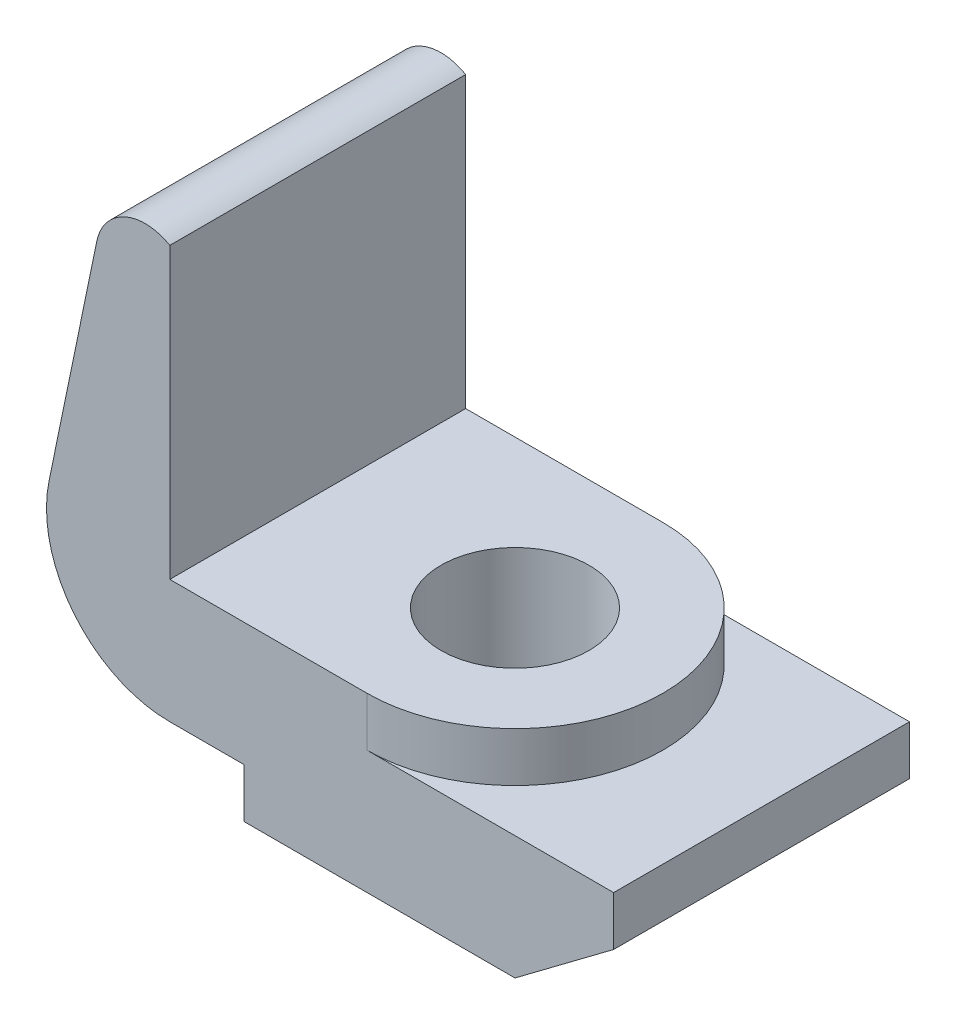
ISO-10303-21;
HEADER;
FILE_DESCRIPTION(('STEP AP214'),'2;1');
FILE_NAME('part.step','',(''),(''),'','','');
FILE_SCHEMA(('AUTOMOTIVE_DESIGN { 1 0 10303 214 1 1 1 1 }'));
ENDSEC;
DATA;
#1=APPLICATION_CONTEXT('core data for automotive mechanical design processes');
#2=APPLICATION_PROTOCOL_DEFINITION('international standard','automotive_design',2000,#1);
#3=PRODUCT_CONTEXT('',#1,'mechanical');
#4=PRODUCT('Part','Part','',(#3));
#5=PRODUCT_RELATED_PRODUCT_CATEGORY('part','',(#4));
#6=PRODUCT_DEFINITION_FORMATION('','',#4);
#7=PRODUCT_DEFINITION_CONTEXT('part definition',#1,'design');
#8=PRODUCT_DEFINITION('design','',#6,#7);
#9=PRODUCT_DEFINITION_SHAPE('','',#8);
#10=(LENGTH_UNIT() NAMED_UNIT(*) SI_UNIT(.MILLI.,.METRE.));
#11=(NAMED_UNIT(*) PLANE_ANGLE_UNIT() SI_UNIT($,.RADIAN.));
#12=(NAMED_UNIT(*) SI_UNIT($,.STERADIAN.) SOLID_ANGLE_UNIT());
#13=UNCERTAINTY_MEASURE_WITH_UNIT(LENGTH_MEASURE(1.E-05),#10,'distance_accuracy_value','');
#14=(GEOMETRIC_REPRESENTATION_CONTEXT(3) GLOBAL_UNCERTAINTY_ASSIGNED_CONTEXT((#13)) GLOBAL_UNIT_ASSIGNED_CONTEXT((#10,
#11,#12)) REPRESENTATION_CONTEXT('',''));
#15=CARTESIAN_POINT('',(0.,0.,0.));
#16=DIRECTION('',(0.,0.,1.));
#17=DIRECTION('',(1.,0.,0.));
#18=AXIS2_PLACEMENT_3D('',#15,#16,#17);
#19=CARTESIAN_POINT('',(0.,0.,76.2));
#20=DIRECTION('',(1.,0.,0.));
#21=DIRECTION('',(0.,1.,0.));
#22=AXIS2_PLACEMENT_3D('',#19,#20,#21);
#23=PLANE('',#22);
#24=DIRECTION('',(0.,-1.,0.));
#25=VECTOR('',#24,1.);
#26=CARTESIAN_POINT('',(0.,0.,0.));
#27=LINE('',#26,#25);
#28=CARTESIAN_POINT('',(0.,74.4985226280624,0.));
#29=VERTEX_POINT('',#28);
#30=CARTESIAN_POINT('',(0.,0.,0.));
#31=VERTEX_POINT('',#30);
#32=EDGE_CURVE('E156',#29,#31,#27,.T.);
#33=ORIENTED_EDGE('',*,*,#32,.F.);
#34=DIRECTION('',(0.,0.,-1.));
#35=VECTOR('',#34,1.);
#36=CARTESIAN_POINT('',(0.,74.4985226280624,76.2));
#37=LINE('',#36,#35);
#38=CARTESIAN_POINT('',(0.,74.4985226280624,76.2));
#39=VERTEX_POINT('',#38);
#40=EDGE_CURVE('E11',#39,#29,#37,.T.);
#41=ORIENTED_EDGE('',*,*,#40,.F.);
#42=DIRECTION('',(0.,-1.,0.));
#43=VECTOR('',#42,1.);
#44=CARTESIAN_POINT('',(0.,0.,76.2));
#45=LINE('',#44,#43);
#46=CARTESIAN_POINT('',(0.,0.,76.2));
#47=VERTEX_POINT('',#46);
#48=EDGE_CURVE('E187',#39,#47,#45,.T.);
#49=ORIENTED_EDGE('',*,*,#48,.T.);
#50=DIRECTION('',(0.,0.,-1.));
#51=VECTOR('',#50,1.);
#52=CARTESIAN_POINT('',(0.,0.,76.2));
#53=LINE('',#52,#51);
#54=EDGE_CURVE('E49',#47,#31,#53,.T.);
#55=ORIENTED_EDGE('',*,*,#54,.T.);
#56=EDGE_LOOP('',(#33,#41,#49,#55));
#57=FACE_BOUND('',#56,.T.);
#58=ADVANCED_FACE('F33',(#57),#23,.T.);
#59=CARTESIAN_POINT('',(-6.35,63.5,76.2));
#60=DIRECTION('',(0.,0.,-1.));
#61=DIRECTION('',(-1.,0.,0.));
#62=AXIS2_PLACEMENT_3D('',#59,#60,#61);
#63=CYLINDRICAL_SURFACE('',#62,12.7);
#64=CARTESIAN_POINT('',(-6.35,63.5,0.));
#65=DIRECTION('',(0.,0.,1.));
#66=DIRECTION('',(1.,0.,0.));
#67=AXIS2_PLACEMENT_3D('',#64,#65,#66);
#68=CIRCLE('',#67,12.7);
#69=CARTESIAN_POINT('',(-18.7880317516973,66.0661968248303,0.));
#70=VERTEX_POINT('',#69);
#71=EDGE_CURVE('E158',#29,#70,#68,.T.);
#72=ORIENTED_EDGE('',*,*,#71,.T.);
#73=DIRECTION('',(0.,0.,-1.));
#74=VECTOR('',#73,1.);
#75=CARTESIAN_POINT('',(-18.7880317516973,66.0661968248303,76.2));
#76=LINE('',#75,#74);
#77=CARTESIAN_POINT('',(-18.7880317516973,66.0661968248303,76.2));
#78=VERTEX_POINT('',#77);
#79=EDGE_CURVE('E41',#78,#70,#76,.T.);
#80=ORIENTED_EDGE('',*,*,#79,.F.);
#81=CARTESIAN_POINT('',(-6.35,63.5,76.2));
#82=DIRECTION('',(0.,0.,1.));
#83=DIRECTION('',(1.,0.,0.));
#84=AXIS2_PLACEMENT_3D('',#81,#82,#83);
#85=CIRCLE('',#84,12.7);
#86=EDGE_CURVE('E224',#39,#78,#85,.T.);
#87=ORIENTED_EDGE('',*,*,#86,.F.);
#88=ORIENTED_EDGE('',*,*,#40,.T.);
#89=EDGE_LOOP('',(#72,#80,#87,#88));
#90=FACE_BOUND('',#89,.T.);
#91=ADVANCED_FACE('F248',(#90),#63,.T.);
#92=CARTESIAN_POINT('',(-31.0950793792433,6.41549206207567,76.2));
#93=DIRECTION('',(0.979372578873806,-0.202062742112619,0.));
#94=DIRECTION('',(0.202062742112619,0.979372578873806,0.));
#95=AXIS2_PLACEMENT_3D('',#92,#93,#94);
#96=PLANE('',#95);
#97=DIRECTION('',(-0.202062742112619,-0.979372578873806,0.));
#98=VECTOR('',#97,1.);
#99=CARTESIAN_POINT('',(-31.0950793792433,6.41549206207567,0.));
#100=LINE('',#99,#98);
#101=CARTESIAN_POINT('',(-31.0950793792434,6.41549206207567,0.));
#102=VERTEX_POINT('',#101);
#103=EDGE_CURVE('E161',#70,#102,#100,.T.);
#104=ORIENTED_EDGE('',*,*,#103,.T.);
#105=DIRECTION('',(0.,0.,-1.));
#106=VECTOR('',#105,1.);
#107=CARTESIAN_POINT('',(-31.0950793792434,6.41549206207567,76.2));
#108=LINE('',#107,#106);
#109=CARTESIAN_POINT('',(-31.0950793792434,6.41549206207567,76.2));
#110=VERTEX_POINT('',#109);
#111=EDGE_CURVE('E197',#110,#102,#108,.T.);
#112=ORIENTED_EDGE('',*,*,#111,.F.);
#113=DIRECTION('',(-0.202062742112619,-0.979372578873806,0.));
#114=VECTOR('',#113,1.);
#115=CARTESIAN_POINT('',(-31.0950793792433,6.41549206207567,76.2));
#116=LINE('',#115,#114);
#117=EDGE_CURVE('E206',#78,#110,#116,.T.);
#118=ORIENTED_EDGE('',*,*,#117,.F.);
#119=ORIENTED_EDGE('',*,*,#79,.T.);
#120=EDGE_LOOP('',(#104,#112,#118,#119));
#121=FACE_BOUND('',#120,.T.);
#122=ADVANCED_FACE('F204',(#121),#96,.F.);
#123=CARTESIAN_POINT('',(0.,0.,76.2));
#124=DIRECTION('',(0.,0.,-1.));
#125=DIRECTION('',(-1.,0.,0.));
#126=AXIS2_PLACEMENT_3D('',#123,#124,#125);
#127=CYLINDRICAL_SURFACE('',#126,31.7500000000001);
#128=CARTESIAN_POINT('',(0.,0.,0.));
#129=DIRECTION('',(0.,0.,1.));
#130=DIRECTION('',(1.,0.,0.));
#131=AXIS2_PLACEMENT_3D('',#128,#129,#130);
#132=CIRCLE('',#131,31.7500000000001);
#133=CARTESIAN_POINT('',(0.,-31.75,0.));
#134=VERTEX_POINT('',#133);
#135=EDGE_CURVE('E163',#102,#134,#132,.T.);
#136=ORIENTED_EDGE('',*,*,#135,.T.);
#137=DIRECTION('',(0.,0.,-1.));
#138=VECTOR('',#137,1.);
#139=CARTESIAN_POINT('',(0.,-31.75,76.2));
#140=LINE('',#139,#138);
#141=CARTESIAN_POINT('',(0.,-31.75,76.2));
#142=VERTEX_POINT('',#141);
#143=EDGE_CURVE('E195',#142,#134,#140,.T.);
#144=ORIENTED_EDGE('',*,*,#143,.F.);
#145=CARTESIAN_POINT('',(0.,0.,76.2));
#146=DIRECTION('',(0.,0.,1.));
#147=DIRECTION('',(1.,0.,0.));
#148=AXIS2_PLACEMENT_3D('',#145,#146,#147);
#149=CIRCLE('',#148,31.7500000000001);
#150=EDGE_CURVE('E218',#110,#142,#149,.T.);
#151=ORIENTED_EDGE('',*,*,#150,.F.);
#152=ORIENTED_EDGE('',*,*,#111,.T.);
#153=EDGE_LOOP('',(#136,#144,#151,#152));
#154=FACE_BOUND('',#153,.T.);
#155=ADVANCED_FACE('F215',(#154),#127,.T.);
#156=CARTESIAN_POINT('',(0.,-31.75,76.2));
#157=DIRECTION('',(0.,-1.,0.));
#158=DIRECTION('',(0.,0.,-1.));
#159=AXIS2_PLACEMENT_3D('',#156,#157,#158);
#160=PLANE('',#159);
#161=DIRECTION('',(-1.,0.,0.));
#162=VECTOR('',#161,1.);
#163=CARTESIAN_POINT('',(0.,-31.75,0.));
#164=LINE('',#163,#162);
#165=CARTESIAN_POINT('',(19.05,-31.75,0.));
#166=VERTEX_POINT('',#165);
#167=EDGE_CURVE('E166',#166,#134,#164,.T.);
#168=ORIENTED_EDGE('',*,*,#167,.F.);
#169=DIRECTION('',(0.,0.,-1.));
#170=VECTOR('',#169,1.);
#171=CARTESIAN_POINT('',(19.05,-31.75,76.2));
#172=LINE('',#171,#170);
#173=CARTESIAN_POINT('',(19.05,-31.75,76.2));
#174=VERTEX_POINT('',#173);
#175=EDGE_CURVE('E193',#174,#166,#172,.T.);
#176=ORIENTED_EDGE('',*,*,#175,.F.);
#177=DIRECTION('',(-1.,0.,0.));
#178=VECTOR('',#177,1.);
#179=CARTESIAN_POINT('',(0.,-31.75,76.2));
#180=LINE('',#179,#178);
#181=EDGE_CURVE('E220',#174,#142,#180,.T.);
#182=ORIENTED_EDGE('',*,*,#181,.T.);
#183=ORIENTED_EDGE('',*,*,#143,.T.);
#184=EDGE_LOOP('',(#168,#176,#182,#183));
#185=FACE_BOUND('',#184,.T.);
#186=ADVANCED_FACE('F258',(#185),#160,.T.);
#187=CARTESIAN_POINT('',(19.05,0.,76.2));
#188=DIRECTION('',(-1.,0.,0.));
#189=DIRECTION('',(0.,0.,1.));
#190=AXIS2_PLACEMENT_3D('',#187,#188,#189);
#191=PLANE('',#190);
#192=DIRECTION('',(0.,1.,0.));
#193=VECTOR('',#192,1.);
#194=CARTESIAN_POINT('',(19.05,0.,0.));
#195=LINE('',#194,#193);
#196=CARTESIAN_POINT('',(19.05,-44.45,0.));
#197=VERTEX_POINT('',#196);
#198=EDGE_CURVE('E169',#197,#166,#195,.T.);
#199=ORIENTED_EDGE('',*,*,#198,.F.);
#200=DIRECTION('',(0.,0.,-1.));
#201=VECTOR('',#200,1.);
#202=CARTESIAN_POINT('',(19.05,-44.45,76.2));
#203=LINE('',#202,#201);
#204=CARTESIAN_POINT('',(19.05,-44.45,76.2));
#205=VERTEX_POINT('',#204);
#206=EDGE_CURVE('E191',#205,#197,#203,.T.);
#207=ORIENTED_EDGE('',*,*,#206,.F.);
#208=DIRECTION('',(0.,1.,0.));
#209=VECTOR('',#208,1.);
#210=CARTESIAN_POINT('',(19.05,0.,76.2));
#211=LINE('',#210,#209);
#212=EDGE_CURVE('E222',#205,#174,#211,.T.);
#213=ORIENTED_EDGE('',*,*,#212,.T.);
#214=ORIENTED_EDGE('',*,*,#175,.T.);
#215=EDGE_LOOP('',(#199,#207,#213,#214));
#216=FACE_BOUND('',#215,.T.);
#217=ADVANCED_FACE('F261',(#216),#191,.T.);
#218=CARTESIAN_POINT('',(0.,-44.45,76.2));
#219=DIRECTION('',(0.,-1.,0.));
#220=DIRECTION('',(1.,0.,0.));
#221=AXIS2_PLACEMENT_3D('',#218,#219,#220);
#222=PLANE('',#221);
#223=CARTESIAN_POINT('',(50.8,-44.45,38.1));
#224=DIRECTION('',(0.,1.,0.));
#225=DIRECTION('',(0.,0.,1.));
#226=AXIS2_PLACEMENT_3D('',#223,#224,#225);
#227=CIRCLE('',#226,19.05);
#228=CARTESIAN_POINT('',(50.8,-44.45,57.15));
#229=VERTEX_POINT('',#228);
#230=EDGE_CURVE('E244',#229,#229,#227,.T.);
#231=ORIENTED_EDGE('',*,*,#230,.T.);
#232=EDGE_LOOP('',(#231));
#233=FACE_BOUND('',#232,.T.);
#234=DIRECTION('',(-1.,0.,0.));
#235=VECTOR('',#234,1.);
#236=CARTESIAN_POINT('',(0.,-44.45,0.));
#237=LINE('',#236,#235);
#238=CARTESIAN_POINT('',(88.9,-44.45,0.));
#239=VERTEX_POINT('',#238);
#240=EDGE_CURVE('E172',#239,#197,#237,.T.);
#241=ORIENTED_EDGE('',*,*,#240,.F.);
#242=DIRECTION('',(0.,0.,-1.));
#243=VECTOR('',#242,1.);
#244=CARTESIAN_POINT('',(88.9,-44.45,76.2));
#245=LINE('',#244,#243);
#246=CARTESIAN_POINT('',(88.9,-44.45,76.2));
#247=VERTEX_POINT('',#246);
#248=EDGE_CURVE('E131',#247,#239,#245,.T.);
#249=ORIENTED_EDGE('',*,*,#248,.F.);
#250=DIRECTION('',(-1.,0.,0.));
#251=VECTOR('',#250,1.);
#252=CARTESIAN_POINT('',(0.,-44.45,76.2));
#253=LINE('',#252,#251);
#254=EDGE_CURVE('E144',#247,#205,#253,.T.);
#255=ORIENTED_EDGE('',*,*,#254,.T.);
#256=ORIENTED_EDGE('',*,*,#206,.T.);
#257=EDGE_LOOP('',(#241,#249,#255,#256));
#258=FACE_BOUND('',#257,.T.);
#259=ADVANCED_FACE('F231',(#233,#258),#222,.T.);
#260=CARTESIAN_POINT('',(53.3399999999999,-71.12,76.2));
#261=DIRECTION('',(0.599999999999999,-0.800000000000001,0.));
#262=DIRECTION('',(0.800000000000001,0.599999999999999,0.));
#263=AXIS2_PLACEMENT_3D('',#260,#261,#262);
#264=PLANE('',#263);
#265=DIRECTION('',(-0.800000000000001,-0.599999999999999,0.));
#266=VECTOR('',#265,1.);
#267=CARTESIAN_POINT('',(53.3399999999999,-71.12,0.));
#268=LINE('',#267,#266);
#269=CARTESIAN_POINT('',(114.3,-25.4,0.));
#270=VERTEX_POINT('',#269);
#271=EDGE_CURVE('E126',#270,#239,#268,.T.);
#272=ORIENTED_EDGE('',*,*,#271,.F.);
#273=DIRECTION('',(0.,0.,-1.));
#274=VECTOR('',#273,1.);
#275=CARTESIAN_POINT('',(114.3,-25.4,76.2));
#276=LINE('',#275,#274);
#277=CARTESIAN_POINT('',(114.3,-25.4,76.2));
#278=VERTEX_POINT('',#277);
#279=EDGE_CURVE('E121',#278,#270,#276,.T.);
#280=ORIENTED_EDGE('',*,*,#279,.F.);
#281=DIRECTION('',(-0.800000000000001,-0.599999999999999,0.));
#282=VECTOR('',#281,1.);
#283=CARTESIAN_POINT('',(53.3399999999999,-71.12,76.2));
#284=LINE('',#283,#282);
#285=EDGE_CURVE('E124',#278,#247,#284,.T.);
#286=ORIENTED_EDGE('',*,*,#285,.T.);
#287=ORIENTED_EDGE('',*,*,#248,.T.);
#288=EDGE_LOOP('',(#272,#280,#286,#287));
#289=FACE_BOUND('',#288,.T.);
#290=ADVANCED_FACE('F123',(#289),#264,.T.);
#291=CARTESIAN_POINT('',(114.3,1.2490009027033E-13,76.2));
#292=DIRECTION('',(1.,0.,0.));
#293=DIRECTION('',(0.,1.,0.));
#294=AXIS2_PLACEMENT_3D('',#291,#292,#293);
#295=PLANE('',#294);
#296=DIRECTION('',(0.,-1.,0.));
#297=VECTOR('',#296,1.);
#298=CARTESIAN_POINT('',(114.3,1.2490009027033E-13,0.));
#299=LINE('',#298,#297);
#300=CARTESIAN_POINT('',(114.3,-12.7,0.));
#301=VERTEX_POINT('',#300);
#302=EDGE_CURVE('E176',#301,#270,#299,.T.);
#303=ORIENTED_EDGE('',*,*,#302,.F.);
#304=DIRECTION('',(0.,0.,-1.));
#305=VECTOR('',#304,1.);
#306=CARTESIAN_POINT('',(114.3,-12.7,76.2));
#307=LINE('',#306,#305);
#308=CARTESIAN_POINT('',(114.3,-12.7,76.2));
#309=VERTEX_POINT('',#308);
#310=EDGE_CURVE('E132',#309,#301,#307,.T.);
#311=ORIENTED_EDGE('',*,*,#310,.F.);
#312=DIRECTION('',(0.,-1.,0.));
#313=VECTOR('',#312,1.);
#314=CARTESIAN_POINT('',(114.3,1.2490009027033E-13,76.2));
#315=LINE('',#314,#313);
#316=EDGE_CURVE('E140',#309,#278,#315,.T.);
#317=ORIENTED_EDGE('',*,*,#316,.T.);
#318=ORIENTED_EDGE('',*,*,#279,.T.);
#319=EDGE_LOOP('',(#303,#311,#317,#318));
#320=FACE_BOUND('',#319,.T.);
#321=ADVANCED_FACE('F146',(#320),#295,.T.);
#322=CARTESIAN_POINT('',(0.,-12.7,76.2));
#323=DIRECTION('',(0.,1.,0.));
#324=DIRECTION('',(-1.,0.,0.));
#325=AXIS2_PLACEMENT_3D('',#322,#323,#324);
#326=PLANE('',#325);
#327=DIRECTION('',(1.,0.,0.));
#328=VECTOR('',#327,1.);
#329=CARTESIAN_POINT('',(0.,-12.7,0.));
#330=LINE('',#329,#328);
#331=CARTESIAN_POINT('',(50.8,-12.7,0.));
#332=VERTEX_POINT('',#331);
#333=EDGE_CURVE('E178',#332,#301,#330,.T.);
#334=ORIENTED_EDGE('',*,*,#333,.F.);
#335=CARTESIAN_POINT('',(50.8,-12.7,38.1));
#336=DIRECTION('',(0.,1.,0.));
#337=DIRECTION('',(-1.,0.,0.));
#338=AXIS2_PLACEMENT_3D('',#335,#336,#337);
#339=CIRCLE('',#338,38.1);
#340=CARTESIAN_POINT('',(50.8,-12.7,76.2));
#341=VERTEX_POINT('',#340);
#342=EDGE_CURVE('E88',#341,#332,#339,.T.);
#343=ORIENTED_EDGE('',*,*,#342,.F.);
#344=DIRECTION('',(1.,0.,0.));
#345=VECTOR('',#344,1.);
#346=CARTESIAN_POINT('',(0.,-12.7,76.2));
#347=LINE('',#346,#345);
#348=EDGE_CURVE('E147',#341,#309,#347,.T.);
#349=ORIENTED_EDGE('',*,*,#348,.T.);
#350=ORIENTED_EDGE('',*,*,#310,.T.);
#351=EDGE_LOOP('',(#334,#343,#349,#350));
#352=FACE_BOUND('',#351,.T.);
#353=ADVANCED_FACE('F234',(#352),#326,.T.);
#354=CARTESIAN_POINT('',(0.,0.,76.2));
#355=DIRECTION('',(0.,1.,0.));
#356=DIRECTION('',(0.,0.,1.));
#357=AXIS2_PLACEMENT_3D('',#354,#355,#356);
#358=PLANE('',#357);
#359=CARTESIAN_POINT('',(50.8,0.,38.1));
#360=DIRECTION('',(0.,1.,0.));
#361=DIRECTION('',(0.,0.,1.));
#362=AXIS2_PLACEMENT_3D('',#359,#360,#361);
#363=CIRCLE('',#362,19.05);
#364=CARTESIAN_POINT('',(50.8,0.,57.15));
#365=VERTEX_POINT('',#364);
#366=EDGE_CURVE('E295',#365,#365,#363,.T.);
#367=ORIENTED_EDGE('',*,*,#366,.F.);
#368=EDGE_LOOP('',(#367));
#369=FACE_BOUND('',#368,.T.);
#370=DIRECTION('',(1.,0.,0.));
#371=VECTOR('',#370,1.);
#372=CARTESIAN_POINT('',(0.,0.,76.2));
#373=LINE('',#372,#371);
#374=CARTESIAN_POINT('',(50.8,0.,76.2));
#375=VERTEX_POINT('',#374);
#376=EDGE_CURVE('E154',#47,#375,#373,.T.);
#377=ORIENTED_EDGE('',*,*,#376,.T.);
#378=CARTESIAN_POINT('',(50.8,0.,38.1));
#379=DIRECTION('',(0.,1.,0.));
#380=DIRECTION('',(0.,0.,1.));
#381=AXIS2_PLACEMENT_3D('',#378,#379,#380);
#382=CIRCLE('',#381,38.1);
#383=CARTESIAN_POINT('',(50.8,0.,0.));
#384=VERTEX_POINT('',#383);
#385=EDGE_CURVE('E159',#375,#384,#382,.T.);
#386=ORIENTED_EDGE('',*,*,#385,.T.);
#387=DIRECTION('',(1.,0.,0.));
#388=VECTOR('',#387,1.);
#389=CARTESIAN_POINT('',(0.,0.,0.));
#390=LINE('',#389,#388);
#391=EDGE_CURVE('E184',#31,#384,#390,.T.);
#392=ORIENTED_EDGE('',*,*,#391,.F.);
#393=ORIENTED_EDGE('',*,*,#54,.F.);
#394=EDGE_LOOP('',(#377,#386,#392,#393));
#395=FACE_BOUND('',#394,.T.);
#396=ADVANCED_FACE('F275',(#369,#395),#358,.T.);
#397=CARTESIAN_POINT('',(0.,0.,76.2));
#398=DIRECTION('',(0.,0.,1.));
#399=DIRECTION('',(1.,0.,0.));
#400=AXIS2_PLACEMENT_3D('',#397,#398,#399);
#401=PLANE('',#400);
#402=ORIENTED_EDGE('',*,*,#48,.F.);
#403=ORIENTED_EDGE('',*,*,#86,.T.);
#404=ORIENTED_EDGE('',*,*,#117,.T.);
#405=ORIENTED_EDGE('',*,*,#150,.T.);
#406=ORIENTED_EDGE('',*,*,#181,.F.);
#407=ORIENTED_EDGE('',*,*,#212,.F.);
#408=ORIENTED_EDGE('',*,*,#254,.F.);
#409=ORIENTED_EDGE('',*,*,#285,.F.);
#410=ORIENTED_EDGE('',*,*,#316,.F.);
#411=ORIENTED_EDGE('',*,*,#348,.F.);
#412=DIRECTION('',(0.,-1.,0.));
#413=VECTOR('',#412,1.);
#414=CARTESIAN_POINT('',(50.8,0.,76.2));
#415=LINE('',#414,#413);
#416=EDGE_CURVE('E149',#375,#341,#415,.T.);
#417=ORIENTED_EDGE('',*,*,#416,.F.);
#418=ORIENTED_EDGE('',*,*,#376,.F.);
#419=EDGE_LOOP('',(#402,#403,#404,#405,#406,#407,#408,#409,#410,#411,#417,#418));
#420=FACE_BOUND('',#419,.T.);
#421=ADVANCED_FACE('F138',(#420),#401,.T.);
#422=CARTESIAN_POINT('',(0.,0.,0.));
#423=DIRECTION('',(0.,0.,1.));
#424=DIRECTION('',(1.,0.,0.));
#425=AXIS2_PLACEMENT_3D('',#422,#423,#424);
#426=PLANE('',#425);
#427=ORIENTED_EDGE('',*,*,#32,.T.);
#428=ORIENTED_EDGE('',*,*,#391,.T.);
#429=DIRECTION('',(0.,-1.,0.));
#430=VECTOR('',#429,1.);
#431=CARTESIAN_POINT('',(50.8,0.,0.));
#432=LINE('',#431,#430);
#433=EDGE_CURVE('E181',#384,#332,#432,.T.);
#434=ORIENTED_EDGE('',*,*,#433,.T.);
#435=ORIENTED_EDGE('',*,*,#333,.T.);
#436=ORIENTED_EDGE('',*,*,#302,.T.);
#437=ORIENTED_EDGE('',*,*,#271,.T.);
#438=ORIENTED_EDGE('',*,*,#240,.T.);
#439=ORIENTED_EDGE('',*,*,#198,.T.);
#440=ORIENTED_EDGE('',*,*,#167,.T.);
#441=ORIENTED_EDGE('',*,*,#135,.F.);
#442=ORIENTED_EDGE('',*,*,#103,.F.);
#443=ORIENTED_EDGE('',*,*,#71,.F.);
#444=EDGE_LOOP('',(#427,#428,#434,#435,#436,#437,#438,#439,#440,#441,#442,#443));
#445=FACE_BOUND('',#444,.T.);
#446=ADVANCED_FACE('F211',(#445),#426,.F.);
#447=CARTESIAN_POINT('',(50.8,107.76307345283,38.1));
#448=DIRECTION('',(0.,-1.,0.));
#449=DIRECTION('',(1.,0.,0.));
#450=AXIS2_PLACEMENT_3D('',#447,#448,#449);
#451=CYLINDRICAL_SURFACE('',#450,38.1);
#452=ORIENTED_EDGE('',*,*,#416,.T.);
#453=ORIENTED_EDGE('',*,*,#342,.T.);
#454=ORIENTED_EDGE('',*,*,#433,.F.);
#455=ORIENTED_EDGE('',*,*,#385,.F.);
#456=EDGE_LOOP('',(#452,#453,#454,#455));
#457=FACE_BOUND('',#456,.T.);
#458=ADVANCED_FACE('F242',(#457),#451,.T.);
#459=CARTESIAN_POINT('',(50.8,0.,38.1));
#460=DIRECTION('',(0.,1.,0.));
#461=DIRECTION('',(0.,0.,1.));
#462=AXIS2_PLACEMENT_3D('',#459,#460,#461);
#463=CYLINDRICAL_SURFACE('',#462,19.05);
#464=ORIENTED_EDGE('',*,*,#230,.F.);
#465=EDGE_LOOP('',(#464));
#466=FACE_BOUND('',#465,.T.);
#467=ORIENTED_EDGE('',*,*,#366,.T.);
#468=EDGE_LOOP('',(#467));
#469=FACE_BOUND('',#468,.T.);
#470=ADVANCED_FACE('F285',(#466,#469),#463,.F.);
#471=CLOSED_SHELL('',(#58,#91,#122,#155,#186,#217,#259,#290,#321,#353,#396,#421,#446,#458,#470));
#472=MANIFOLD_SOLID_BREP('B2',#471);
#473=ADVANCED_BREP_SHAPE_REPRESENTATION('',(#18,#472),#14);
#474=SHAPE_DEFINITION_REPRESENTATION(#9,#473);
ENDSEC;
END-ISO-10303-21;
